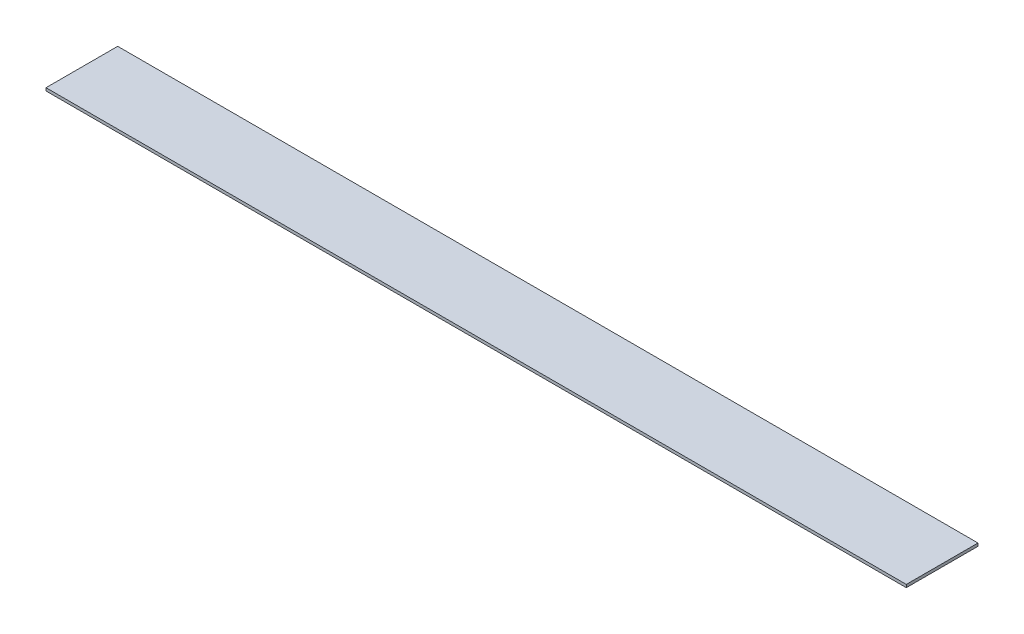
ISO-10303-21;
HEADER;
FILE_DESCRIPTION(('STEP AP214'),'2;1');
FILE_NAME('part.step','',(''),(''),'','','');
FILE_SCHEMA(('AUTOMOTIVE_DESIGN { 1 0 10303 214 1 1 1 1 }'));
ENDSEC;
DATA;
#1=APPLICATION_CONTEXT('core data for automotive mechanical design processes');
#2=APPLICATION_PROTOCOL_DEFINITION('international standard','automotive_design',2000,#1);
#3=PRODUCT_CONTEXT('',#1,'mechanical');
#4=PRODUCT('Part','Part','',(#3));
#5=PRODUCT_RELATED_PRODUCT_CATEGORY('part','',(#4));
#6=PRODUCT_DEFINITION_FORMATION('','',#4);
#7=PRODUCT_DEFINITION_CONTEXT('part definition',#1,'design');
#8=PRODUCT_DEFINITION('design','',#6,#7);
#9=PRODUCT_DEFINITION_SHAPE('','',#8);
#10=(LENGTH_UNIT() NAMED_UNIT(*) SI_UNIT(.MILLI.,.METRE.));
#11=(NAMED_UNIT(*) PLANE_ANGLE_UNIT() SI_UNIT($,.RADIAN.));
#12=(NAMED_UNIT(*) SI_UNIT($,.STERADIAN.) SOLID_ANGLE_UNIT());
#13=UNCERTAINTY_MEASURE_WITH_UNIT(LENGTH_MEASURE(1.E-05),#10,'distance_accuracy_value','');
#14=(GEOMETRIC_REPRESENTATION_CONTEXT(3) GLOBAL_UNCERTAINTY_ASSIGNED_CONTEXT((#13)) GLOBAL_UNIT_ASSIGNED_CONTEXT((#10,
#11,#12)) REPRESENTATION_CONTEXT('',''));
#15=CARTESIAN_POINT('',(0.,0.,0.));
#16=DIRECTION('',(0.,0.,1.));
#17=DIRECTION('',(1.,0.,0.));
#18=AXIS2_PLACEMENT_3D('',#15,#16,#17);
#19=CARTESIAN_POINT('',(150.,1.,-12.5));
#20=DIRECTION('',(-1.,0.,0.));
#21=DIRECTION('',(0.,0.,1.));
#22=AXIS2_PLACEMENT_3D('',#19,#20,#21);
#23=PLANE('',#22);
#24=DIRECTION('',(0.,0.,-1.));
#25=VECTOR('',#24,1.);
#26=CARTESIAN_POINT('',(150.,0.,-12.5));
#27=LINE('',#26,#25);
#28=CARTESIAN_POINT('',(150.,0.,12.5));
#29=VERTEX_POINT('',#28);
#30=CARTESIAN_POINT('',(150.,0.,-12.5));
#31=VERTEX_POINT('',#30);
#32=EDGE_CURVE('E95',#29,#31,#27,.T.);
#33=ORIENTED_EDGE('',*,*,#32,.T.);
#34=DIRECTION('',(0.,-1.,0.));
#35=VECTOR('',#34,1.);
#36=CARTESIAN_POINT('',(150.,1.,-12.5));
#37=LINE('',#36,#35);
#38=CARTESIAN_POINT('',(150.,1.,-12.5));
#39=VERTEX_POINT('',#38);
#40=EDGE_CURVE('E11',#39,#31,#37,.T.);
#41=ORIENTED_EDGE('',*,*,#40,.F.);
#42=DIRECTION('',(0.,0.,-1.));
#43=VECTOR('',#42,1.);
#44=CARTESIAN_POINT('',(150.,1.,-12.5));
#45=LINE('',#44,#43);
#46=CARTESIAN_POINT('',(150.,1.,12.5));
#47=VERTEX_POINT('',#46);
#48=EDGE_CURVE('E83',#47,#39,#45,.T.);
#49=ORIENTED_EDGE('',*,*,#48,.F.);
#50=DIRECTION('',(0.,-1.,0.));
#51=VECTOR('',#50,1.);
#52=CARTESIAN_POINT('',(150.,1.,12.5));
#53=LINE('',#52,#51);
#54=EDGE_CURVE('E91',#47,#29,#53,.T.);
#55=ORIENTED_EDGE('',*,*,#54,.T.);
#56=EDGE_LOOP('',(#33,#41,#49,#55));
#57=FACE_BOUND('',#56,.T.);
#58=ADVANCED_FACE('F32',(#57),#23,.F.);
#59=CARTESIAN_POINT('',(-150.,1.,-12.5));
#60=DIRECTION('',(0.,0.,1.));
#61=DIRECTION('',(1.,0.,0.));
#62=AXIS2_PLACEMENT_3D('',#59,#60,#61);
#63=PLANE('',#62);
#64=DIRECTION('',(-1.,0.,0.));
#65=VECTOR('',#64,1.);
#66=CARTESIAN_POINT('',(-150.,0.,-12.5));
#67=LINE('',#66,#65);
#68=CARTESIAN_POINT('',(-150.,0.,-12.5));
#69=VERTEX_POINT('',#68);
#70=EDGE_CURVE('E87',#31,#69,#67,.T.);
#71=ORIENTED_EDGE('',*,*,#70,.T.);
#72=DIRECTION('',(0.,-1.,0.));
#73=VECTOR('',#72,1.);
#74=CARTESIAN_POINT('',(-150.,1.,-12.5));
#75=LINE('',#74,#73);
#76=CARTESIAN_POINT('',(-150.,1.,-12.5));
#77=VERTEX_POINT('',#76);
#78=EDGE_CURVE('E40',#77,#69,#75,.T.);
#79=ORIENTED_EDGE('',*,*,#78,.F.);
#80=DIRECTION('',(-1.,0.,0.));
#81=VECTOR('',#80,1.);
#82=CARTESIAN_POINT('',(-150.,1.,-12.5));
#83=LINE('',#82,#81);
#84=EDGE_CURVE('E78',#39,#77,#83,.T.);
#85=ORIENTED_EDGE('',*,*,#84,.F.);
#86=ORIENTED_EDGE('',*,*,#40,.T.);
#87=EDGE_LOOP('',(#71,#79,#85,#86));
#88=FACE_BOUND('',#87,.T.);
#89=ADVANCED_FACE('F86',(#88),#63,.F.);
#90=CARTESIAN_POINT('',(-150.,1.,-12.5));
#91=DIRECTION('',(1.,0.,0.));
#92=DIRECTION('',(0.,0.,-1.));
#93=AXIS2_PLACEMENT_3D('',#90,#91,#92);
#94=PLANE('',#93);
#95=DIRECTION('',(0.,0.,1.));
#96=VECTOR('',#95,1.);
#97=CARTESIAN_POINT('',(-150.,0.,-12.5));
#98=LINE('',#97,#96);
#99=CARTESIAN_POINT('',(-150.,0.,12.5));
#100=VERTEX_POINT('',#99);
#101=EDGE_CURVE('E65',#69,#100,#98,.T.);
#102=ORIENTED_EDGE('',*,*,#101,.T.);
#103=DIRECTION('',(0.,-1.,0.));
#104=VECTOR('',#103,1.);
#105=CARTESIAN_POINT('',(-150.,1.,12.5));
#106=LINE('',#105,#104);
#107=CARTESIAN_POINT('',(-150.,1.,12.5));
#108=VERTEX_POINT('',#107);
#109=EDGE_CURVE('E88',#108,#100,#106,.T.);
#110=ORIENTED_EDGE('',*,*,#109,.F.);
#111=DIRECTION('',(0.,0.,1.));
#112=VECTOR('',#111,1.);
#113=CARTESIAN_POINT('',(-150.,1.,-12.5));
#114=LINE('',#113,#112);
#115=EDGE_CURVE('E81',#77,#108,#114,.T.);
#116=ORIENTED_EDGE('',*,*,#115,.F.);
#117=ORIENTED_EDGE('',*,*,#78,.T.);
#118=EDGE_LOOP('',(#102,#110,#116,#117));
#119=FACE_BOUND('',#118,.T.);
#120=ADVANCED_FACE('F89',(#119),#94,.F.);
#121=CARTESIAN_POINT('',(-150.,1.,12.5));
#122=DIRECTION('',(0.,0.,-1.));
#123=DIRECTION('',(-1.,0.,0.));
#124=AXIS2_PLACEMENT_3D('',#121,#122,#123);
#125=PLANE('',#124);
#126=DIRECTION('',(1.,0.,0.));
#127=VECTOR('',#126,1.);
#128=CARTESIAN_POINT('',(-150.,0.,12.5));
#129=LINE('',#128,#127);
#130=EDGE_CURVE('E71',#100,#29,#129,.T.);
#131=ORIENTED_EDGE('',*,*,#130,.T.);
#132=ORIENTED_EDGE('',*,*,#54,.F.);
#133=DIRECTION('',(1.,0.,0.));
#134=VECTOR('',#133,1.);
#135=CARTESIAN_POINT('',(-150.,1.,12.5));
#136=LINE('',#135,#134);
#137=EDGE_CURVE('E48',#108,#47,#136,.T.);
#138=ORIENTED_EDGE('',*,*,#137,.F.);
#139=ORIENTED_EDGE('',*,*,#109,.T.);
#140=EDGE_LOOP('',(#131,#132,#138,#139));
#141=FACE_BOUND('',#140,.T.);
#142=ADVANCED_FACE('F102',(#141),#125,.F.);
#143=CARTESIAN_POINT('',(0.,1.,0.));
#144=DIRECTION('',(0.,1.,0.));
#145=DIRECTION('',(0.,0.,1.));
#146=AXIS2_PLACEMENT_3D('',#143,#144,#145);
#147=PLANE('',#146);
#148=ORIENTED_EDGE('',*,*,#48,.T.);
#149=ORIENTED_EDGE('',*,*,#84,.T.);
#150=ORIENTED_EDGE('',*,*,#115,.T.);
#151=ORIENTED_EDGE('',*,*,#137,.T.);
#152=EDGE_LOOP('',(#148,#149,#150,#151));
#153=FACE_BOUND('',#152,.T.);
#154=ADVANCED_FACE('F79',(#153),#147,.T.);
#155=CARTESIAN_POINT('',(0.,0.,0.));
#156=DIRECTION('',(0.,1.,0.));
#157=DIRECTION('',(0.,0.,1.));
#158=AXIS2_PLACEMENT_3D('',#155,#156,#157);
#159=PLANE('',#158);
#160=ORIENTED_EDGE('',*,*,#32,.F.);
#161=ORIENTED_EDGE('',*,*,#130,.F.);
#162=ORIENTED_EDGE('',*,*,#101,.F.);
#163=ORIENTED_EDGE('',*,*,#70,.F.);
#164=EDGE_LOOP('',(#160,#161,#162,#163));
#165=FACE_BOUND('',#164,.T.);
#166=ADVANCED_FACE('F105',(#165),#159,.F.);
#167=CLOSED_SHELL('',(#58,#89,#120,#142,#154,#166));
#168=MANIFOLD_SOLID_BREP('B2',#167);
#169=ADVANCED_BREP_SHAPE_REPRESENTATION('',(#18,#168),#14);
#170=SHAPE_DEFINITION_REPRESENTATION(#9,#169);
ENDSEC;
END-ISO-10303-21;
